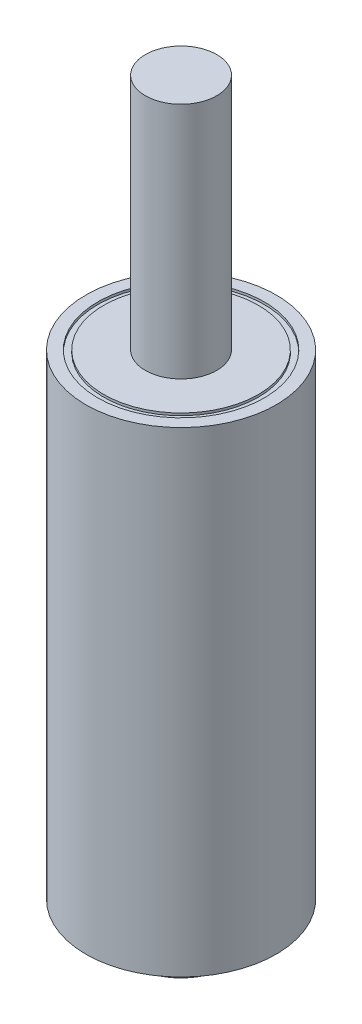
ISO-10303-21;
HEADER;
FILE_DESCRIPTION(('STEP AP214'),'2;1');
FILE_NAME('part.step','',(''),(''),'','','');
FILE_SCHEMA(('AUTOMOTIVE_DESIGN { 1 0 10303 214 1 1 1 1 }'));
ENDSEC;
DATA;
#1=APPLICATION_CONTEXT('core data for automotive mechanical design processes');
#2=APPLICATION_PROTOCOL_DEFINITION('international standard','automotive_design',2000,#1);
#3=PRODUCT_CONTEXT('',#1,'mechanical');
#4=PRODUCT('Part','Part','',(#3));
#5=PRODUCT_RELATED_PRODUCT_CATEGORY('part','',(#4));
#6=PRODUCT_DEFINITION_FORMATION('','',#4);
#7=PRODUCT_DEFINITION_CONTEXT('part definition',#1,'design');
#8=PRODUCT_DEFINITION('design','',#6,#7);
#9=PRODUCT_DEFINITION_SHAPE('','',#8);
#10=(LENGTH_UNIT() NAMED_UNIT(*) SI_UNIT(.MILLI.,.METRE.));
#11=(NAMED_UNIT(*) PLANE_ANGLE_UNIT() SI_UNIT($,.RADIAN.));
#12=(NAMED_UNIT(*) SI_UNIT($,.STERADIAN.) SOLID_ANGLE_UNIT());
#13=UNCERTAINTY_MEASURE_WITH_UNIT(LENGTH_MEASURE(1.E-05),#10,'distance_accuracy_value','');
#14=(GEOMETRIC_REPRESENTATION_CONTEXT(3) GLOBAL_UNCERTAINTY_ASSIGNED_CONTEXT((#13)) GLOBAL_UNIT_ASSIGNED_CONTEXT((#10,
#11,#12)) REPRESENTATION_CONTEXT('',''));
#15=CARTESIAN_POINT('',(0.,0.,0.));
#16=DIRECTION('',(0.,0.,1.));
#17=DIRECTION('',(1.,0.,0.));
#18=AXIS2_PLACEMENT_3D('',#15,#16,#17);
#19=CARTESIAN_POINT('',(0.,20.,0.));
#20=DIRECTION('',(0.,1.,0.));
#21=DIRECTION('',(0.,0.,1.));
#22=AXIS2_PLACEMENT_3D('',#19,#20,#21);
#23=PLANE('',#22);
#24=CARTESIAN_POINT('',(0.,20.,0.));
#25=DIRECTION('',(0.,1.,0.));
#26=DIRECTION('',(0.,0.,1.));
#27=AXIS2_PLACEMENT_3D('',#24,#25,#26);
#28=CIRCLE('',#27,3.5);
#29=CARTESIAN_POINT('',(0.,20.,3.5));
#30=VERTEX_POINT('',#29);
#31=EDGE_CURVE('E214',#30,#30,#28,.T.);
#32=ORIENTED_EDGE('',*,*,#31,.F.);
#33=EDGE_LOOP('',(#32));
#34=FACE_BOUND('',#33,.T.);
#35=CARTESIAN_POINT('',(0.,20.,0.));
#36=DIRECTION('',(0.,1.,0.));
#37=DIRECTION('',(0.,0.,1.));
#38=AXIS2_PLACEMENT_3D('',#35,#36,#37);
#39=CIRCLE('',#38,4.);
#40=CARTESIAN_POINT('',(0.,20.,4.));
#41=VERTEX_POINT('',#40);
#42=EDGE_CURVE('E142',#41,#41,#39,.T.);
#43=ORIENTED_EDGE('',*,*,#42,.T.);
#44=EDGE_LOOP('',(#43));
#45=FACE_BOUND('',#44,.T.);
#46=ADVANCED_FACE('F49',(#34,#45),#23,.T.);
#47=CARTESIAN_POINT('',(0.,-1.2,0.));
#48=DIRECTION('',(0.,-1.,0.));
#49=DIRECTION('',(0.,0.,-1.));
#50=AXIS2_PLACEMENT_3D('',#47,#48,#49);
#51=PLANE('',#50);
#52=CARTESIAN_POINT('',(0.,-1.2,0.));
#53=DIRECTION('',(0.,-1.,0.));
#54=DIRECTION('',(0.,0.,-1.));
#55=AXIS2_PLACEMENT_3D('',#52,#53,#54);
#56=CIRCLE('',#55,1.25);
#57=CARTESIAN_POINT('',(0.,-1.2,-1.25));
#58=VERTEX_POINT('',#57);
#59=CARTESIAN_POINT('',(1.25,-1.2,0.));
#60=VERTEX_POINT('',#59);
#61=EDGE_CURVE('E118',#58,#60,#56,.T.);
#62=ORIENTED_EDGE('',*,*,#61,.F.);
#63=DIRECTION('',(0.,0.,1.));
#64=VECTOR('',#63,1.);
#65=CARTESIAN_POINT('',(0.,-1.2,-1.25));
#66=LINE('',#65,#64);
#67=CARTESIAN_POINT('',(0.,-1.2,-1.9));
#68=VERTEX_POINT('',#67);
#69=EDGE_CURVE('E230',#68,#58,#66,.T.);
#70=ORIENTED_EDGE('',*,*,#69,.F.);
#71=CARTESIAN_POINT('',(0.,-1.2,0.));
#72=DIRECTION('',(0.,-1.,0.));
#73=DIRECTION('',(0.,0.,-1.));
#74=AXIS2_PLACEMENT_3D('',#71,#72,#73);
#75=CIRCLE('',#74,1.9);
#76=CARTESIAN_POINT('',(1.9,-1.2,0.));
#77=VERTEX_POINT('',#76);
#78=EDGE_CURVE('E156',#68,#77,#75,.T.);
#79=ORIENTED_EDGE('',*,*,#78,.T.);
#80=DIRECTION('',(1.,0.,0.));
#81=VECTOR('',#80,1.);
#82=CARTESIAN_POINT('',(1.25,-1.2,0.));
#83=LINE('',#82,#81);
#84=EDGE_CURVE('E112',#60,#77,#83,.T.);
#85=ORIENTED_EDGE('',*,*,#84,.F.);
#86=EDGE_LOOP('',(#62,#70,#79,#85));
#87=FACE_BOUND('',#86,.T.);
#88=ADVANCED_FACE('F177',(#87),#51,.T.);
#89=CARTESIAN_POINT('',(0.,-1.7,0.));
#90=DIRECTION('',(0.,1.,0.));
#91=DIRECTION('',(0.,0.,1.));
#92=AXIS2_PLACEMENT_3D('',#89,#90,#91);
#93=CYLINDRICAL_SURFACE('',#92,1.25);
#94=CARTESIAN_POINT('',(0.,-1.5,0.));
#95=DIRECTION('',(0.,-1.,0.));
#96=DIRECTION('',(0.,0.,-1.));
#97=AXIS2_PLACEMENT_3D('',#94,#95,#96);
#98=CIRCLE('',#97,1.25);
#99=CARTESIAN_POINT('',(0.,-1.5,-1.25));
#100=VERTEX_POINT('',#99);
#101=EDGE_CURVE('E12',#100,#100,#98,.F.);
#102=ORIENTED_EDGE('',*,*,#101,.T.);
#103=EDGE_LOOP('',(#102));
#104=FACE_BOUND('',#103,.T.);
#105=DIRECTION('',(0.,1.,0.));
#106=VECTOR('',#105,1.);
#107=CARTESIAN_POINT('',(0.,-1.45,-1.25));
#108=LINE('',#107,#106);
#109=CARTESIAN_POINT('',(0.,-1.45,-1.25));
#110=VERTEX_POINT('',#109);
#111=EDGE_CURVE('E64',#110,#58,#108,.T.);
#112=ORIENTED_EDGE('',*,*,#111,.T.);
#113=ORIENTED_EDGE('',*,*,#61,.T.);
#114=DIRECTION('',(0.,1.,0.));
#115=VECTOR('',#114,1.);
#116=CARTESIAN_POINT('',(1.25,-1.45,0.));
#117=LINE('',#116,#115);
#118=CARTESIAN_POINT('',(1.25,-1.45,0.));
#119=VERTEX_POINT('',#118);
#120=EDGE_CURVE('E120',#119,#60,#117,.T.);
#121=ORIENTED_EDGE('',*,*,#120,.F.);
#122=CARTESIAN_POINT('',(0.,-1.45,0.));
#123=DIRECTION('',(0.,1.,0.));
#124=DIRECTION('',(0.,0.,-1.));
#125=AXIS2_PLACEMENT_3D('',#122,#123,#124);
#126=CIRCLE('',#125,1.25);
#127=EDGE_CURVE('E102',#110,#119,#126,.T.);
#128=ORIENTED_EDGE('',*,*,#127,.F.);
#129=EDGE_LOOP('',(#112,#113,#121,#128));
#130=FACE_BOUND('',#129,.T.);
#131=ADVANCED_FACE('F186',(#104,#130),#93,.T.);
#132=CARTESIAN_POINT('',(0.,0.,0.));
#133=DIRECTION('',(0.,1.,0.));
#134=DIRECTION('',(0.,0.,1.));
#135=AXIS2_PLACEMENT_3D('',#132,#133,#134);
#136=PLANE('',#135);
#137=CARTESIAN_POINT('',(0.,0.,0.));
#138=DIRECTION('',(0.,-1.,0.));
#139=DIRECTION('',(1.,0.,0.));
#140=AXIS2_PLACEMENT_3D('',#137,#138,#139);
#141=CIRCLE('',#140,3.25);
#142=CARTESIAN_POINT('',(3.25,0.,0.));
#143=VERTEX_POINT('',#142);
#144=EDGE_CURVE('E129',#143,#143,#141,.T.);
#145=ORIENTED_EDGE('',*,*,#144,.T.);
#146=EDGE_LOOP('',(#145));
#147=FACE_BOUND('',#146,.T.);
#148=CARTESIAN_POINT('',(0.,0.,0.));
#149=DIRECTION('',(0.,1.,0.));
#150=DIRECTION('',(0.,0.,1.));
#151=AXIS2_PLACEMENT_3D('',#148,#149,#150);
#152=CIRCLE('',#151,2.);
#153=CARTESIAN_POINT('',(0.,0.,2.));
#154=VERTEX_POINT('',#153);
#155=EDGE_CURVE('E145',#154,#154,#152,.F.);
#156=ORIENTED_EDGE('',*,*,#155,.F.);
#157=EDGE_LOOP('',(#156));
#158=FACE_BOUND('',#157,.T.);
#159=ADVANCED_FACE('F245',(#147,#158),#136,.F.);
#160=CARTESIAN_POINT('',(0.,20.,0.));
#161=DIRECTION('',(0.,-1.,0.));
#162=DIRECTION('',(0.,0.,-1.));
#163=AXIS2_PLACEMENT_3D('',#160,#161,#162);
#164=CYLINDRICAL_SURFACE('',#163,4.);
#165=ORIENTED_EDGE('',*,*,#42,.F.);
#166=EDGE_LOOP('',(#165));
#167=FACE_BOUND('',#166,.T.);
#168=CARTESIAN_POINT('',(0.,0.,0.));
#169=DIRECTION('',(0.,1.,0.));
#170=DIRECTION('',(0.,0.,1.));
#171=AXIS2_PLACEMENT_3D('',#168,#169,#170);
#172=CIRCLE('',#171,4.);
#173=CARTESIAN_POINT('',(0.,0.,4.));
#174=VERTEX_POINT('',#173);
#175=EDGE_CURVE('E139',#174,#174,#172,.T.);
#176=ORIENTED_EDGE('',*,*,#175,.T.);
#177=EDGE_LOOP('',(#176));
#178=FACE_BOUND('',#177,.T.);
#179=ADVANCED_FACE('F251',(#167,#178),#164,.T.);
#180=CARTESIAN_POINT('',(0.,0.,0.));
#181=DIRECTION('',(0.,-1.,0.));
#182=DIRECTION('',(0.,0.,-1.));
#183=AXIS2_PLACEMENT_3D('',#180,#181,#182);
#184=CIRCLE('',#183,3.5);
#185=CARTESIAN_POINT('',(0.,0.,-3.5));
#186=VERTEX_POINT('',#185);
#187=EDGE_CURVE('E133',#186,#186,#184,.T.);
#188=ORIENTED_EDGE('',*,*,#187,.F.);
#189=EDGE_LOOP('',(#188));
#190=FACE_BOUND('',#189,.T.);
#191=ORIENTED_EDGE('',*,*,#175,.F.);
#192=EDGE_LOOP('',(#191));
#193=FACE_BOUND('',#192,.T.);
#194=ADVANCED_FACE('F253',(#190,#193),#136,.F.);
#195=CARTESIAN_POINT('',(0.,0.1,0.));
#196=DIRECTION('',(0.,-1.,0.));
#197=DIRECTION('',(0.,0.,-1.));
#198=AXIS2_PLACEMENT_3D('',#195,#196,#197);
#199=CYLINDRICAL_SURFACE('',#198,3.5);
#200=CARTESIAN_POINT('',(0.,0.1,0.));
#201=DIRECTION('',(0.,-1.,0.));
#202=DIRECTION('',(0.,0.,-1.));
#203=AXIS2_PLACEMENT_3D('',#200,#201,#202);
#204=CIRCLE('',#203,3.5);
#205=CARTESIAN_POINT('',(0.,0.1,-3.5));
#206=VERTEX_POINT('',#205);
#207=EDGE_CURVE('E136',#206,#206,#204,.T.);
#208=ORIENTED_EDGE('',*,*,#207,.F.);
#209=EDGE_LOOP('',(#208));
#210=FACE_BOUND('',#209,.T.);
#211=ORIENTED_EDGE('',*,*,#187,.T.);
#212=EDGE_LOOP('',(#211));
#213=FACE_BOUND('',#212,.T.);
#214=ADVANCED_FACE('F274',(#210,#213),#199,.F.);
#215=CARTESIAN_POINT('',(0.,0.1,0.));
#216=DIRECTION('',(0.,-1.,0.));
#217=DIRECTION('',(0.,0.,-1.));
#218=AXIS2_PLACEMENT_3D('',#215,#216,#217);
#219=PLANE('',#218);
#220=CARTESIAN_POINT('',(0.,0.1,0.));
#221=DIRECTION('',(0.,-1.,0.));
#222=DIRECTION('',(1.,0.,0.));
#223=AXIS2_PLACEMENT_3D('',#220,#221,#222);
#224=CIRCLE('',#223,3.25);
#225=CARTESIAN_POINT('',(3.25,0.1,0.));
#226=VERTEX_POINT('',#225);
#227=EDGE_CURVE('E130',#226,#226,#224,.T.);
#228=ORIENTED_EDGE('',*,*,#227,.F.);
#229=EDGE_LOOP('',(#228));
#230=FACE_BOUND('',#229,.T.);
#231=ORIENTED_EDGE('',*,*,#207,.T.);
#232=EDGE_LOOP('',(#231));
#233=FACE_BOUND('',#232,.T.);
#234=ADVANCED_FACE('F271',(#230,#233),#219,.T.);
#235=CARTESIAN_POINT('',(0.,0.1,0.));
#236=DIRECTION('',(0.,-1.,0.));
#237=DIRECTION('',(0.,0.,-1.));
#238=AXIS2_PLACEMENT_3D('',#235,#236,#237);
#239=CYLINDRICAL_SURFACE('',#238,3.25);
#240=ORIENTED_EDGE('',*,*,#227,.T.);
#241=EDGE_LOOP('',(#240));
#242=FACE_BOUND('',#241,.T.);
#243=ORIENTED_EDGE('',*,*,#144,.F.);
#244=EDGE_LOOP('',(#243));
#245=FACE_BOUND('',#244,.T.);
#246=ADVANCED_FACE('F267',(#242,#245),#239,.T.);
#247=CARTESIAN_POINT('',(0.,-0.2,0.));
#248=DIRECTION('',(0.,1.,0.));
#249=DIRECTION('',(0.,0.,1.));
#250=AXIS2_PLACEMENT_3D('',#247,#248,#249);
#251=CYLINDRICAL_SURFACE('',#250,2.);
#252=CARTESIAN_POINT('',(0.,-0.1,0.));
#253=DIRECTION('',(0.,-1.,0.));
#254=DIRECTION('',(0.,0.,-1.));
#255=AXIS2_PLACEMENT_3D('',#252,#253,#254);
#256=CIRCLE('',#255,2.);
#257=CARTESIAN_POINT('',(0.,-0.1,-2.));
#258=VERTEX_POINT('',#257);
#259=EDGE_CURVE('E153',#258,#258,#256,.F.);
#260=ORIENTED_EDGE('',*,*,#259,.T.);
#261=EDGE_LOOP('',(#260));
#262=FACE_BOUND('',#261,.T.);
#263=ORIENTED_EDGE('',*,*,#155,.T.);
#264=EDGE_LOOP('',(#263));
#265=FACE_BOUND('',#264,.T.);
#266=ADVANCED_FACE('F264',(#262,#265),#251,.T.);
#267=CARTESIAN_POINT('',(0.,-0.1,0.));
#268=DIRECTION('',(0.,-1.,0.));
#269=DIRECTION('',(0.,0.,-1.));
#270=AXIS2_PLACEMENT_3D('',#267,#268,#269);
#271=TOROIDAL_SURFACE('',#270,1.9,0.1);
#272=ORIENTED_EDGE('',*,*,#259,.F.);
#273=EDGE_LOOP('',(#272));
#274=FACE_BOUND('',#273,.T.);
#275=CARTESIAN_POINT('',(0.,-0.2,0.));
#276=DIRECTION('',(0.,-1.,0.));
#277=DIRECTION('',(0.,0.,-1.));
#278=AXIS2_PLACEMENT_3D('',#275,#276,#277);
#279=CIRCLE('',#278,1.9);
#280=CARTESIAN_POINT('',(0.,-0.2,-1.9));
#281=VERTEX_POINT('',#280);
#282=EDGE_CURVE('E150',#281,#281,#279,.T.);
#283=ORIENTED_EDGE('',*,*,#282,.F.);
#284=EDGE_LOOP('',(#283));
#285=FACE_BOUND('',#284,.T.);
#286=ADVANCED_FACE('F262',(#274,#285),#271,.T.);
#287=CARTESIAN_POINT('',(0.,-1.2,0.));
#288=DIRECTION('',(0.,1.,0.));
#289=DIRECTION('',(0.,0.,1.));
#290=AXIS2_PLACEMENT_3D('',#287,#288,#289);
#291=CYLINDRICAL_SURFACE('',#290,2.);
#292=CARTESIAN_POINT('',(0.,-1.1,0.));
#293=DIRECTION('',(0.,-1.,0.));
#294=DIRECTION('',(0.,0.,-1.));
#295=AXIS2_PLACEMENT_3D('',#292,#293,#294);
#296=CIRCLE('',#295,2.);
#297=CARTESIAN_POINT('',(0.,-1.1,-2.));
#298=VERTEX_POINT('',#297);
#299=EDGE_CURVE('E159',#298,#298,#296,.F.);
#300=ORIENTED_EDGE('',*,*,#299,.T.);
#301=EDGE_LOOP('',(#300));
#302=FACE_BOUND('',#301,.T.);
#303=CARTESIAN_POINT('',(0.,-0.2,0.));
#304=DIRECTION('',(0.,-1.,0.));
#305=DIRECTION('',(0.,0.,-1.));
#306=AXIS2_PLACEMENT_3D('',#303,#304,#305);
#307=CIRCLE('',#306,2.);
#308=CARTESIAN_POINT('',(0.,-0.2,-2.));
#309=VERTEX_POINT('',#308);
#310=EDGE_CURVE('E126',#309,#309,#307,.T.);
#311=ORIENTED_EDGE('',*,*,#310,.T.);
#312=EDGE_LOOP('',(#311));
#313=FACE_BOUND('',#312,.T.);
#314=ADVANCED_FACE('F258',(#302,#313),#291,.T.);
#315=CARTESIAN_POINT('',(0.,-0.2,0.));
#316=DIRECTION('',(0.,-1.,0.));
#317=DIRECTION('',(0.,0.,-1.));
#318=AXIS2_PLACEMENT_3D('',#315,#316,#317);
#319=PLANE('',#318);
#320=ORIENTED_EDGE('',*,*,#282,.T.);
#321=EDGE_LOOP('',(#320));
#322=FACE_BOUND('',#321,.T.);
#323=ORIENTED_EDGE('',*,*,#310,.F.);
#324=EDGE_LOOP('',(#323));
#325=FACE_BOUND('',#324,.T.);
#326=ADVANCED_FACE('F255',(#322,#325),#319,.F.);
#327=CARTESIAN_POINT('',(0.,-1.1,0.));
#328=DIRECTION('',(0.,-1.,0.));
#329=DIRECTION('',(0.,0.,-1.));
#330=AXIS2_PLACEMENT_3D('',#327,#328,#329);
#331=TOROIDAL_SURFACE('',#330,1.9,0.1);
#332=ORIENTED_EDGE('',*,*,#299,.F.);
#333=EDGE_LOOP('',(#332));
#334=FACE_BOUND('',#333,.T.);
#335=ORIENTED_EDGE('',*,*,#78,.F.);
#336=CARTESIAN_POINT('',(0.,-1.2,0.));
#337=DIRECTION('',(0.,-1.,0.));
#338=DIRECTION('',(0.,0.,-1.));
#339=AXIS2_PLACEMENT_3D('',#336,#337,#338);
#340=CIRCLE('',#339,1.9);
#341=EDGE_CURVE('E72',#68,#77,#340,.F.);
#342=ORIENTED_EDGE('',*,*,#341,.T.);
#343=EDGE_LOOP('',(#335,#342));
#344=FACE_BOUND('',#343,.T.);
#345=ADVANCED_FACE('F173',(#334,#344),#331,.T.);
#346=CARTESIAN_POINT('',(0.,-1.7,0.));
#347=DIRECTION('',(0.,-1.,0.));
#348=DIRECTION('',(0.,0.,-1.));
#349=AXIS2_PLACEMENT_3D('',#346,#347,#348);
#350=PLANE('',#349);
#351=CARTESIAN_POINT('',(0.,-1.7,0.));
#352=DIRECTION('',(0.,-1.,0.));
#353=DIRECTION('',(0.,0.,-1.));
#354=AXIS2_PLACEMENT_3D('',#351,#352,#353);
#355=CIRCLE('',#354,1.05);
#356=CARTESIAN_POINT('',(0.,-1.7,-1.05));
#357=VERTEX_POINT('',#356);
#358=EDGE_CURVE('E57',#357,#357,#355,.T.);
#359=ORIENTED_EDGE('',*,*,#358,.T.);
#360=EDGE_LOOP('',(#359));
#361=FACE_BOUND('',#360,.T.);
#362=ADVANCED_FACE('F164',(#361),#350,.T.);
#363=CARTESIAN_POINT('',(0.,-1.7,0.));
#364=DIRECTION('',(0.,1.,0.));
#365=DIRECTION('',(0.,0.,1.));
#366=AXIS2_PLACEMENT_3D('',#363,#364,#365);
#367=CONICAL_SURFACE('',#366,1.05,0.785398163397447);
#368=ORIENTED_EDGE('',*,*,#101,.F.);
#369=EDGE_LOOP('',(#368));
#370=FACE_BOUND('',#369,.T.);
#371=ORIENTED_EDGE('',*,*,#358,.F.);
#372=EDGE_LOOP('',(#371));
#373=FACE_BOUND('',#372,.T.);
#374=ADVANCED_FACE('F51',(#370,#373),#367,.T.);
#375=CARTESIAN_POINT('',(0.,-1.45,0.));
#376=DIRECTION('',(0.,1.,0.));
#377=DIRECTION('',(0.,0.,1.));
#378=AXIS2_PLACEMENT_3D('',#375,#376,#377);
#379=CYLINDRICAL_SURFACE('',#378,2.);
#380=CARTESIAN_POINT('',(0.,-1.2,0.));
#381=DIRECTION('',(0.,-1.,0.));
#382=DIRECTION('',(0.,0.,-1.));
#383=AXIS2_PLACEMENT_3D('',#380,#381,#382);
#384=CIRCLE('',#383,2.);
#385=CARTESIAN_POINT('',(2.,-1.2,0.));
#386=VERTEX_POINT('',#385);
#387=CARTESIAN_POINT('',(0.,-1.2,-2.));
#388=VERTEX_POINT('',#387);
#389=EDGE_CURVE('E116',#386,#388,#384,.T.);
#390=ORIENTED_EDGE('',*,*,#389,.T.);
#391=DIRECTION('',(0.,1.,0.));
#392=VECTOR('',#391,1.);
#393=CARTESIAN_POINT('',(0.,-1.45,-2.));
#394=LINE('',#393,#392);
#395=CARTESIAN_POINT('',(0.,-1.45,-2.));
#396=VERTEX_POINT('',#395);
#397=EDGE_CURVE('E98',#396,#388,#394,.T.);
#398=ORIENTED_EDGE('',*,*,#397,.F.);
#399=CARTESIAN_POINT('',(0.,-1.45,0.));
#400=DIRECTION('',(0.,-1.,0.));
#401=DIRECTION('',(0.,0.,-1.));
#402=AXIS2_PLACEMENT_3D('',#399,#400,#401);
#403=CIRCLE('',#402,2.);
#404=CARTESIAN_POINT('',(2.,-1.45,0.));
#405=VERTEX_POINT('',#404);
#406=EDGE_CURVE('E103',#405,#396,#403,.T.);
#407=ORIENTED_EDGE('',*,*,#406,.F.);
#408=DIRECTION('',(0.,1.,0.));
#409=VECTOR('',#408,1.);
#410=CARTESIAN_POINT('',(2.,-1.45,0.));
#411=LINE('',#410,#409);
#412=EDGE_CURVE('E228',#405,#386,#411,.T.);
#413=ORIENTED_EDGE('',*,*,#412,.T.);
#414=EDGE_LOOP('',(#390,#398,#407,#413));
#415=FACE_BOUND('',#414,.T.);
#416=ADVANCED_FACE('F114',(#415),#379,.T.);
#417=CARTESIAN_POINT('',(0.,-1.45,-1.25));
#418=DIRECTION('',(-1.,0.,0.));
#419=DIRECTION('',(0.,0.,1.));
#420=AXIS2_PLACEMENT_3D('',#417,#418,#419);
#421=PLANE('',#420);
#422=EDGE_CURVE('E231',#388,#68,#66,.T.);
#423=ORIENTED_EDGE('',*,*,#422,.T.);
#424=ORIENTED_EDGE('',*,*,#69,.T.);
#425=ORIENTED_EDGE('',*,*,#111,.F.);
#426=DIRECTION('',(0.,0.,1.));
#427=VECTOR('',#426,1.);
#428=CARTESIAN_POINT('',(0.,-1.45,-1.25));
#429=LINE('',#428,#427);
#430=EDGE_CURVE('E94',#396,#110,#429,.T.);
#431=ORIENTED_EDGE('',*,*,#430,.F.);
#432=ORIENTED_EDGE('',*,*,#397,.T.);
#433=EDGE_LOOP('',(#423,#424,#425,#431,#432));
#434=FACE_BOUND('',#433,.T.);
#435=ADVANCED_FACE('F96',(#434),#421,.F.);
#436=CARTESIAN_POINT('',(1.25,-1.45,0.));
#437=DIRECTION('',(0.,0.,1.));
#438=DIRECTION('',(1.,0.,0.));
#439=AXIS2_PLACEMENT_3D('',#436,#437,#438);
#440=PLANE('',#439);
#441=ORIENTED_EDGE('',*,*,#84,.T.);
#442=EDGE_CURVE('E233',#77,#386,#83,.T.);
#443=ORIENTED_EDGE('',*,*,#442,.T.);
#444=ORIENTED_EDGE('',*,*,#412,.F.);
#445=DIRECTION('',(1.,0.,0.));
#446=VECTOR('',#445,1.);
#447=CARTESIAN_POINT('',(1.25,-1.45,0.));
#448=LINE('',#447,#446);
#449=EDGE_CURVE('E108',#119,#405,#448,.T.);
#450=ORIENTED_EDGE('',*,*,#449,.F.);
#451=ORIENTED_EDGE('',*,*,#120,.T.);
#452=EDGE_LOOP('',(#441,#443,#444,#450,#451));
#453=FACE_BOUND('',#452,.T.);
#454=ADVANCED_FACE('F239',(#453),#440,.F.);
#455=CARTESIAN_POINT('',(0.,-1.45,0.));
#456=DIRECTION('',(0.,-1.,0.));
#457=DIRECTION('',(0.,0.,-1.));
#458=AXIS2_PLACEMENT_3D('',#455,#456,#457);
#459=PLANE('',#458);
#460=ORIENTED_EDGE('',*,*,#406,.T.);
#461=ORIENTED_EDGE('',*,*,#430,.T.);
#462=ORIENTED_EDGE('',*,*,#127,.T.);
#463=ORIENTED_EDGE('',*,*,#449,.T.);
#464=EDGE_LOOP('',(#460,#461,#462,#463));
#465=FACE_BOUND('',#464,.T.);
#466=ADVANCED_FACE('F106',(#465),#459,.T.);
#467=CARTESIAN_POINT('',(0.,-1.2,0.));
#468=DIRECTION('',(0.,-1.,0.));
#469=DIRECTION('',(0.,0.,-1.));
#470=AXIS2_PLACEMENT_3D('',#467,#468,#469);
#471=PLANE('',#470);
#472=ORIENTED_EDGE('',*,*,#341,.F.);
#473=ORIENTED_EDGE('',*,*,#422,.F.);
#474=ORIENTED_EDGE('',*,*,#389,.F.);
#475=ORIENTED_EDGE('',*,*,#442,.F.);
#476=EDGE_LOOP('',(#472,#473,#474,#475));
#477=FACE_BOUND('',#476,.T.);
#478=ADVANCED_FACE('F367',(#477),#471,.F.);
#479=CARTESIAN_POINT('',(0.,19.9,0.));
#480=DIRECTION('',(0.,1.,0.));
#481=DIRECTION('',(0.,0.,1.));
#482=AXIS2_PLACEMENT_3D('',#479,#480,#481);
#483=CYLINDRICAL_SURFACE('',#482,3.5);
#484=CARTESIAN_POINT('',(0.,19.9,0.));
#485=DIRECTION('',(0.,1.,0.));
#486=DIRECTION('',(0.,0.,1.));
#487=AXIS2_PLACEMENT_3D('',#484,#485,#486);
#488=CIRCLE('',#487,3.5);
#489=CARTESIAN_POINT('',(0.,19.9,3.5));
#490=VERTEX_POINT('',#489);
#491=EDGE_CURVE('E217',#490,#490,#488,.T.);
#492=ORIENTED_EDGE('',*,*,#491,.F.);
#493=EDGE_LOOP('',(#492));
#494=FACE_BOUND('',#493,.T.);
#495=ORIENTED_EDGE('',*,*,#31,.T.);
#496=EDGE_LOOP('',(#495));
#497=FACE_BOUND('',#496,.T.);
#498=ADVANCED_FACE('F376',(#494,#497),#483,.F.);
#499=CARTESIAN_POINT('',(0.,19.9,0.));
#500=DIRECTION('',(0.,1.,0.));
#501=DIRECTION('',(0.,0.,1.));
#502=AXIS2_PLACEMENT_3D('',#499,#500,#501);
#503=PLANE('',#502);
#504=CARTESIAN_POINT('',(0.,19.9,0.));
#505=DIRECTION('',(0.,1.,0.));
#506=DIRECTION('',(1.,0.,0.));
#507=AXIS2_PLACEMENT_3D('',#504,#505,#506);
#508=CIRCLE('',#507,3.25);
#509=CARTESIAN_POINT('',(3.25,19.9,0.));
#510=VERTEX_POINT('',#509);
#511=EDGE_CURVE('E211',#510,#510,#508,.T.);
#512=ORIENTED_EDGE('',*,*,#511,.F.);
#513=EDGE_LOOP('',(#512));
#514=FACE_BOUND('',#513,.T.);
#515=ORIENTED_EDGE('',*,*,#491,.T.);
#516=EDGE_LOOP('',(#515));
#517=FACE_BOUND('',#516,.T.);
#518=ADVANCED_FACE('F400',(#514,#517),#503,.T.);
#519=CARTESIAN_POINT('',(0.,19.9,0.));
#520=DIRECTION('',(0.,1.,0.));
#521=DIRECTION('',(0.,0.,1.));
#522=AXIS2_PLACEMENT_3D('',#519,#520,#521);
#523=CYLINDRICAL_SURFACE('',#522,3.25);
#524=ORIENTED_EDGE('',*,*,#511,.T.);
#525=EDGE_LOOP('',(#524));
#526=FACE_BOUND('',#525,.T.);
#527=CARTESIAN_POINT('',(0.,20.,0.));
#528=DIRECTION('',(0.,1.,0.));
#529=DIRECTION('',(1.,0.,0.));
#530=AXIS2_PLACEMENT_3D('',#527,#528,#529);
#531=CIRCLE('',#530,3.25);
#532=CARTESIAN_POINT('',(3.25,20.,0.));
#533=VERTEX_POINT('',#532);
#534=EDGE_CURVE('E209',#533,#533,#531,.T.);
#535=ORIENTED_EDGE('',*,*,#534,.F.);
#536=EDGE_LOOP('',(#535));
#537=FACE_BOUND('',#536,.T.);
#538=ADVANCED_FACE('F390',(#526,#537),#523,.T.);
#539=CARTESIAN_POINT('',(0.,30.,0.));
#540=DIRECTION('',(0.,1.,0.));
#541=DIRECTION('',(0.,0.,1.));
#542=AXIS2_PLACEMENT_3D('',#539,#540,#541);
#543=PLANE('',#542);
#544=CARTESIAN_POINT('',(0.,30.,0.));
#545=DIRECTION('',(0.,1.,0.));
#546=DIRECTION('',(0.,0.,1.));
#547=AXIS2_PLACEMENT_3D('',#544,#545,#546);
#548=CIRCLE('',#547,1.5);
#549=CARTESIAN_POINT('',(0.,30.,1.5));
#550=VERTEX_POINT('',#549);
#551=EDGE_CURVE('E222',#550,#550,#548,.T.);
#552=ORIENTED_EDGE('',*,*,#551,.T.);
#553=EDGE_LOOP('',(#552));
#554=FACE_BOUND('',#553,.T.);
#555=ADVANCED_FACE('F200',(#554),#543,.T.);
#556=CARTESIAN_POINT('',(0.,30.,0.));
#557=DIRECTION('',(0.,-1.,0.));
#558=DIRECTION('',(0.,0.,-1.));
#559=AXIS2_PLACEMENT_3D('',#556,#557,#558);
#560=CYLINDRICAL_SURFACE('',#559,1.5);
#561=ORIENTED_EDGE('',*,*,#551,.F.);
#562=EDGE_LOOP('',(#561));
#563=FACE_BOUND('',#562,.T.);
#564=CARTESIAN_POINT('',(0.,20.,0.));
#565=DIRECTION('',(0.,1.,0.));
#566=DIRECTION('',(0.,0.,1.));
#567=AXIS2_PLACEMENT_3D('',#564,#565,#566);
#568=CIRCLE('',#567,1.5);
#569=CARTESIAN_POINT('',(0.,20.,1.5));
#570=VERTEX_POINT('',#569);
#571=EDGE_CURVE('E206',#570,#570,#568,.T.);
#572=ORIENTED_EDGE('',*,*,#571,.T.);
#573=EDGE_LOOP('',(#572));
#574=FACE_BOUND('',#573,.T.);
#575=ADVANCED_FACE('F194',(#563,#574),#560,.T.);
#576=ORIENTED_EDGE('',*,*,#571,.F.);
#577=EDGE_LOOP('',(#576));
#578=FACE_BOUND('',#577,.T.);
#579=ORIENTED_EDGE('',*,*,#534,.T.);
#580=EDGE_LOOP('',(#579));
#581=FACE_BOUND('',#580,.T.);
#582=ADVANCED_FACE('F180',(#578,#581),#23,.T.);
#583=CLOSED_SHELL('',(#46,#88,#131,#159,#179,#194,#214,#234,#246,#266,#286,#314,#326,#345,#362,
#374,#416,#435,#454,#466,#478,#498,#518,#538,#555,#575,#582));
#584=MANIFOLD_SOLID_BREP('B2',#583);
#585=ADVANCED_BREP_SHAPE_REPRESENTATION('',(#18,#584),#14);
#586=SHAPE_DEFINITION_REPRESENTATION(#9,#585);
ENDSEC;
END-ISO-10303-21;
